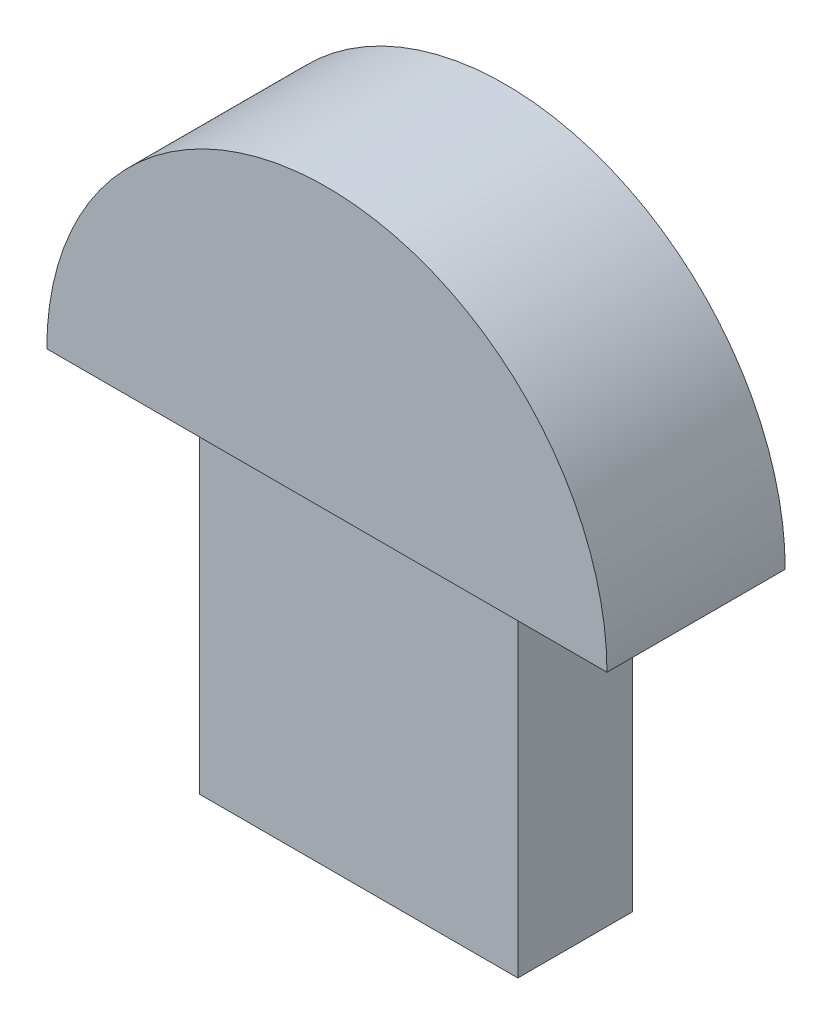
ISO-10303-21;
HEADER;
FILE_DESCRIPTION(('STEP AP214'),'2;1');
FILE_NAME('part.step','',(''),(''),'','','');
FILE_SCHEMA(('AUTOMOTIVE_DESIGN { 1 0 10303 214 1 1 1 1 }'));
ENDSEC;
DATA;
#1=APPLICATION_CONTEXT('core data for automotive mechanical design processes');
#2=APPLICATION_PROTOCOL_DEFINITION('international standard','automotive_design',2000,#1);
#3=PRODUCT_CONTEXT('',#1,'mechanical');
#4=PRODUCT('Part','Part','',(#3));
#5=PRODUCT_RELATED_PRODUCT_CATEGORY('part','',(#4));
#6=PRODUCT_DEFINITION_FORMATION('','',#4);
#7=PRODUCT_DEFINITION_CONTEXT('part definition',#1,'design');
#8=PRODUCT_DEFINITION('design','',#6,#7);
#9=PRODUCT_DEFINITION_SHAPE('','',#8);
#10=(LENGTH_UNIT() NAMED_UNIT(*) SI_UNIT(.MILLI.,.METRE.));
#11=(NAMED_UNIT(*) PLANE_ANGLE_UNIT() SI_UNIT($,.RADIAN.));
#12=(NAMED_UNIT(*) SI_UNIT($,.STERADIAN.) SOLID_ANGLE_UNIT());
#13=UNCERTAINTY_MEASURE_WITH_UNIT(LENGTH_MEASURE(1.E-05),#10,'distance_accuracy_value','');
#14=(GEOMETRIC_REPRESENTATION_CONTEXT(3) GLOBAL_UNCERTAINTY_ASSIGNED_CONTEXT((#13)) GLOBAL_UNIT_ASSIGNED_CONTEXT((#10,
#11,#12)) REPRESENTATION_CONTEXT('',''));
#15=CARTESIAN_POINT('',(0.,0.,0.));
#16=DIRECTION('',(0.,0.,1.));
#17=DIRECTION('',(1.,0.,0.));
#18=AXIS2_PLACEMENT_3D('',#15,#16,#17);
#19=CARTESIAN_POINT('',(6.2499999999999,13.4,-2.25000000000003));
#20=DIRECTION('',(-1.,0.,0.));
#21=DIRECTION('',(0.,0.,1.));
#22=AXIS2_PLACEMENT_3D('',#19,#20,#21);
#23=PLANE('',#22);
#24=DIRECTION('',(0.,0.,-1.));
#25=VECTOR('',#24,1.);
#26=CARTESIAN_POINT('',(6.2499999999999,0.,-2.25000000000003));
#27=LINE('',#26,#25);
#28=CARTESIAN_POINT('',(6.2499999999999,0.,2.24999999999997));
#29=VERTEX_POINT('',#28);
#30=CARTESIAN_POINT('',(6.2499999999999,0.,-2.25000000000003));
#31=VERTEX_POINT('',#30);
#32=EDGE_CURVE('E128',#29,#31,#27,.T.);
#33=ORIENTED_EDGE('',*,*,#32,.T.);
#34=DIRECTION('',(0.,-1.,0.));
#35=VECTOR('',#34,1.);
#36=CARTESIAN_POINT('',(6.2499999999999,13.4,-2.25000000000003));
#37=LINE('',#36,#35);
#38=CARTESIAN_POINT('',(6.2499999999999,13.4,-2.25000000000003));
#39=VERTEX_POINT('',#38);
#40=EDGE_CURVE('E11',#39,#31,#37,.T.);
#41=ORIENTED_EDGE('',*,*,#40,.F.);
#42=DIRECTION('',(0.,0.,-1.));
#43=VECTOR('',#42,1.);
#44=CARTESIAN_POINT('',(6.2499999999999,13.4,-2.25000000000003));
#45=LINE('',#44,#43);
#46=CARTESIAN_POINT('',(6.2499999999999,13.4,2.24999999999997));
#47=VERTEX_POINT('',#46);
#48=EDGE_CURVE('E138',#47,#39,#45,.T.);
#49=ORIENTED_EDGE('',*,*,#48,.F.);
#50=DIRECTION('',(0.,-1.,0.));
#51=VECTOR('',#50,1.);
#52=CARTESIAN_POINT('',(6.2499999999999,13.4,2.24999999999997));
#53=LINE('',#52,#51);
#54=EDGE_CURVE('E151',#47,#29,#53,.T.);
#55=ORIENTED_EDGE('',*,*,#54,.T.);
#56=EDGE_LOOP('',(#33,#41,#49,#55));
#57=FACE_BOUND('',#56,.T.);
#58=ADVANCED_FACE('F43',(#57),#23,.F.);
#59=CARTESIAN_POINT('',(-6.2500000000001,13.4,-2.25000000000003));
#60=DIRECTION('',(0.,0.,1.));
#61=DIRECTION('',(1.,0.,0.));
#62=AXIS2_PLACEMENT_3D('',#59,#60,#61);
#63=PLANE('',#62);
#64=DIRECTION('',(-1.,0.,0.));
#65=VECTOR('',#64,1.);
#66=CARTESIAN_POINT('',(-6.2500000000001,0.,-2.25000000000003));
#67=LINE('',#66,#65);
#68=CARTESIAN_POINT('',(-6.2500000000001,0.,-2.25000000000003));
#69=VERTEX_POINT('',#68);
#70=EDGE_CURVE('E133',#31,#69,#67,.T.);
#71=ORIENTED_EDGE('',*,*,#70,.T.);
#72=DIRECTION('',(0.,-1.,0.));
#73=VECTOR('',#72,1.);
#74=CARTESIAN_POINT('',(-6.2500000000001,13.4,-2.25000000000003));
#75=LINE('',#74,#73);
#76=CARTESIAN_POINT('',(-6.2500000000001,13.4,-2.25000000000003));
#77=VERTEX_POINT('',#76);
#78=EDGE_CURVE('E52',#77,#69,#75,.T.);
#79=ORIENTED_EDGE('',*,*,#78,.F.);
#80=DIRECTION('',(-1.,0.,0.));
#81=VECTOR('',#80,1.);
#82=CARTESIAN_POINT('',(-6.2500000000001,13.4,-2.25000000000003));
#83=LINE('',#82,#81);
#84=EDGE_CURVE('E86',#39,#77,#83,.T.);
#85=ORIENTED_EDGE('',*,*,#84,.F.);
#86=ORIENTED_EDGE('',*,*,#40,.T.);
#87=EDGE_LOOP('',(#71,#79,#85,#86));
#88=FACE_BOUND('',#87,.T.);
#89=ADVANCED_FACE('F179',(#88),#63,.F.);
#90=CARTESIAN_POINT('',(-6.2500000000001,13.4,-2.25000000000003));
#91=DIRECTION('',(1.,0.,0.));
#92=DIRECTION('',(0.,0.,-1.));
#93=AXIS2_PLACEMENT_3D('',#90,#91,#92);
#94=PLANE('',#93);
#95=DIRECTION('',(0.,0.,1.));
#96=VECTOR('',#95,1.);
#97=CARTESIAN_POINT('',(-6.2500000000001,0.,-2.25000000000003));
#98=LINE('',#97,#96);
#99=CARTESIAN_POINT('',(-6.2500000000001,0.,2.24999999999997));
#100=VERTEX_POINT('',#99);
#101=EDGE_CURVE('E76',#69,#100,#98,.T.);
#102=ORIENTED_EDGE('',*,*,#101,.T.);
#103=DIRECTION('',(0.,-1.,0.));
#104=VECTOR('',#103,1.);
#105=CARTESIAN_POINT('',(-6.2500000000001,13.4,2.24999999999997));
#106=LINE('',#105,#104);
#107=CARTESIAN_POINT('',(-6.2500000000001,13.4,2.24999999999997));
#108=VERTEX_POINT('',#107);
#109=EDGE_CURVE('E60',#108,#100,#106,.T.);
#110=ORIENTED_EDGE('',*,*,#109,.F.);
#111=DIRECTION('',(0.,0.,1.));
#112=VECTOR('',#111,1.);
#113=CARTESIAN_POINT('',(-6.2500000000001,13.4,-2.25000000000003));
#114=LINE('',#113,#112);
#115=EDGE_CURVE('E144',#77,#108,#114,.T.);
#116=ORIENTED_EDGE('',*,*,#115,.F.);
#117=ORIENTED_EDGE('',*,*,#78,.T.);
#118=EDGE_LOOP('',(#102,#110,#116,#117));
#119=FACE_BOUND('',#118,.T.);
#120=ADVANCED_FACE('F163',(#119),#94,.F.);
#121=CARTESIAN_POINT('',(-6.2500000000001,13.4,2.24999999999997));
#122=DIRECTION('',(0.,0.,-1.));
#123=DIRECTION('',(-1.,0.,0.));
#124=AXIS2_PLACEMENT_3D('',#121,#122,#123);
#125=PLANE('',#124);
#126=DIRECTION('',(1.,0.,0.));
#127=VECTOR('',#126,1.);
#128=CARTESIAN_POINT('',(-6.2500000000001,0.,2.24999999999997));
#129=LINE('',#128,#127);
#130=EDGE_CURVE('E81',#100,#29,#129,.T.);
#131=ORIENTED_EDGE('',*,*,#130,.T.);
#132=ORIENTED_EDGE('',*,*,#54,.F.);
#133=DIRECTION('',(1.,0.,0.));
#134=VECTOR('',#133,1.);
#135=CARTESIAN_POINT('',(-6.2500000000001,13.4,2.24999999999997));
#136=LINE('',#135,#134);
#137=EDGE_CURVE('E148',#108,#47,#136,.T.);
#138=ORIENTED_EDGE('',*,*,#137,.F.);
#139=ORIENTED_EDGE('',*,*,#109,.T.);
#140=EDGE_LOOP('',(#131,#132,#138,#139));
#141=FACE_BOUND('',#140,.T.);
#142=ADVANCED_FACE('F168',(#141),#125,.F.);
#143=CARTESIAN_POINT('',(0.,0.,0.));
#144=DIRECTION('',(0.,1.,0.));
#145=DIRECTION('',(0.,0.,1.));
#146=AXIS2_PLACEMENT_3D('',#143,#144,#145);
#147=PLANE('',#146);
#148=ORIENTED_EDGE('',*,*,#32,.F.);
#149=ORIENTED_EDGE('',*,*,#130,.F.);
#150=ORIENTED_EDGE('',*,*,#101,.F.);
#151=ORIENTED_EDGE('',*,*,#70,.F.);
#152=EDGE_LOOP('',(#148,#149,#150,#151));
#153=FACE_BOUND('',#152,.T.);
#154=ADVANCED_FACE('F166',(#153),#147,.F.);
#155=CARTESIAN_POINT('',(-11.,13.4,3.5));
#156=DIRECTION('',(0.,1.,0.));
#157=DIRECTION('',(0.,0.,1.));
#158=AXIS2_PLACEMENT_3D('',#155,#156,#157);
#159=PLANE('',#158);
#160=DIRECTION('',(1.,0.,0.));
#161=VECTOR('',#160,1.);
#162=CARTESIAN_POINT('',(-11.,13.4,-3.5));
#163=LINE('',#162,#161);
#164=CARTESIAN_POINT('',(-11.,13.4,-3.5));
#165=VERTEX_POINT('',#164);
#166=CARTESIAN_POINT('',(11.,13.4,-3.5));
#167=VERTEX_POINT('',#166);
#168=EDGE_CURVE('E122',#165,#167,#163,.T.);
#169=ORIENTED_EDGE('',*,*,#168,.T.);
#170=DIRECTION('',(0.,0.,-1.));
#171=VECTOR('',#170,1.);
#172=CARTESIAN_POINT('',(11.,13.4,3.5));
#173=LINE('',#172,#171);
#174=CARTESIAN_POINT('',(11.,13.4,3.5));
#175=VERTEX_POINT('',#174);
#176=EDGE_CURVE('E113',#175,#167,#173,.T.);
#177=ORIENTED_EDGE('',*,*,#176,.F.);
#178=DIRECTION('',(1.,0.,0.));
#179=VECTOR('',#178,1.);
#180=CARTESIAN_POINT('',(-11.,13.4,3.5));
#181=LINE('',#180,#179);
#182=CARTESIAN_POINT('',(-11.,13.4,3.5));
#183=VERTEX_POINT('',#182);
#184=EDGE_CURVE('E105',#183,#175,#181,.T.);
#185=ORIENTED_EDGE('',*,*,#184,.F.);
#186=DIRECTION('',(0.,0.,-1.));
#187=VECTOR('',#186,1.);
#188=CARTESIAN_POINT('',(-11.,13.4,3.5));
#189=LINE('',#188,#187);
#190=EDGE_CURVE('E110',#183,#165,#189,.T.);
#191=ORIENTED_EDGE('',*,*,#190,.T.);
#192=EDGE_LOOP('',(#169,#177,#185,#191));
#193=FACE_BOUND('',#192,.T.);
#194=ORIENTED_EDGE('',*,*,#137,.T.);
#195=ORIENTED_EDGE('',*,*,#48,.T.);
#196=ORIENTED_EDGE('',*,*,#84,.T.);
#197=ORIENTED_EDGE('',*,*,#115,.T.);
#198=EDGE_LOOP('',(#194,#195,#196,#197));
#199=FACE_BOUND('',#198,.T.);
#200=ADVANCED_FACE('F107',(#193,#199),#159,.F.);
#201=CARTESIAN_POINT('',(0.,13.4,3.5));
#202=DIRECTION('',(0.,0.,-1.));
#203=DIRECTION('',(-1.,0.,0.));
#204=AXIS2_PLACEMENT_3D('',#201,#202,#203);
#205=CYLINDRICAL_SURFACE('',#204,11.);
#206=CARTESIAN_POINT('',(0.,13.4,-3.5));
#207=DIRECTION('',(0.,0.,1.));
#208=DIRECTION('',(-1.,0.,0.));
#209=AXIS2_PLACEMENT_3D('',#206,#207,#208);
#210=CIRCLE('',#209,11.);
#211=EDGE_CURVE('E126',#167,#165,#210,.T.);
#212=ORIENTED_EDGE('',*,*,#211,.T.);
#213=ORIENTED_EDGE('',*,*,#190,.F.);
#214=CARTESIAN_POINT('',(0.,13.4,3.5));
#215=DIRECTION('',(0.,0.,1.));
#216=DIRECTION('',(-1.,0.,0.));
#217=AXIS2_PLACEMENT_3D('',#214,#215,#216);
#218=CIRCLE('',#217,11.);
#219=EDGE_CURVE('E117',#175,#183,#218,.T.);
#220=ORIENTED_EDGE('',*,*,#219,.F.);
#221=ORIENTED_EDGE('',*,*,#176,.T.);
#222=EDGE_LOOP('',(#212,#213,#220,#221));
#223=FACE_BOUND('',#222,.T.);
#224=ADVANCED_FACE('F124',(#223),#205,.T.);
#225=CARTESIAN_POINT('',(0.,13.4,3.5));
#226=DIRECTION('',(0.,0.,-1.));
#227=DIRECTION('',(-1.,0.,0.));
#228=AXIS2_PLACEMENT_3D('',#225,#226,#227);
#229=PLANE('',#228);
#230=ORIENTED_EDGE('',*,*,#219,.T.);
#231=ORIENTED_EDGE('',*,*,#184,.T.);
#232=EDGE_LOOP('',(#230,#231));
#233=FACE_BOUND('',#232,.T.);
#234=ADVANCED_FACE('F119',(#233),#229,.F.);
#235=CARTESIAN_POINT('',(0.,13.4,-3.5));
#236=DIRECTION('',(0.,0.,-1.));
#237=DIRECTION('',(-1.,0.,0.));
#238=AXIS2_PLACEMENT_3D('',#235,#236,#237);
#239=PLANE('',#238);
#240=ORIENTED_EDGE('',*,*,#211,.F.);
#241=ORIENTED_EDGE('',*,*,#168,.F.);
#242=EDGE_LOOP('',(#240,#241));
#243=FACE_BOUND('',#242,.T.);
#244=ADVANCED_FACE('F214',(#243),#239,.T.);
#245=CLOSED_SHELL('',(#58,#89,#120,#142,#154,#200,#224,#234,#244));
#246=MANIFOLD_SOLID_BREP('B2',#245);
#247=ADVANCED_BREP_SHAPE_REPRESENTATION('',(#18,#246),#14);
#248=SHAPE_DEFINITION_REPRESENTATION(#9,#247);
ENDSEC;
END-ISO-10303-21;
